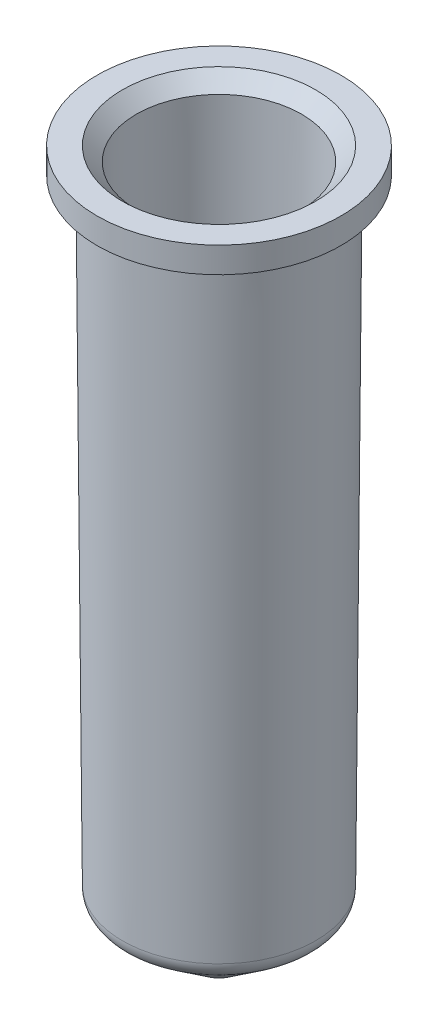
ISO-10303-21;
HEADER;
FILE_DESCRIPTION(('STEP AP214'),'2;1');
FILE_NAME('part.step','',(''),(''),'','','');
FILE_SCHEMA(('AUTOMOTIVE_DESIGN { 1 0 10303 214 1 1 1 1 }'));
ENDSEC;
DATA;
#1=APPLICATION_CONTEXT('core data for automotive mechanical design processes');
#2=APPLICATION_PROTOCOL_DEFINITION('international standard','automotive_design',2000,#1);
#3=PRODUCT_CONTEXT('',#1,'mechanical');
#4=PRODUCT('Part','Part','',(#3));
#5=PRODUCT_RELATED_PRODUCT_CATEGORY('part','',(#4));
#6=PRODUCT_DEFINITION_FORMATION('','',#4);
#7=PRODUCT_DEFINITION_CONTEXT('part definition',#1,'design');
#8=PRODUCT_DEFINITION('design','',#6,#7);
#9=PRODUCT_DEFINITION_SHAPE('','',#8);
#10=(LENGTH_UNIT() NAMED_UNIT(*) SI_UNIT(.MILLI.,.METRE.));
#11=(NAMED_UNIT(*) PLANE_ANGLE_UNIT() SI_UNIT($,.RADIAN.));
#12=(NAMED_UNIT(*) SI_UNIT($,.STERADIAN.) SOLID_ANGLE_UNIT());
#13=UNCERTAINTY_MEASURE_WITH_UNIT(LENGTH_MEASURE(1.E-05),#10,'distance_accuracy_value','');
#14=(GEOMETRIC_REPRESENTATION_CONTEXT(3) GLOBAL_UNCERTAINTY_ASSIGNED_CONTEXT((#13)) GLOBAL_UNIT_ASSIGNED_CONTEXT((#10,
#11,#12)) REPRESENTATION_CONTEXT('',''));
#15=CARTESIAN_POINT('',(0.,0.,0.));
#16=DIRECTION('',(0.,0.,1.));
#17=DIRECTION('',(1.,0.,0.));
#18=AXIS2_PLACEMENT_3D('',#15,#16,#17);
#19=CARTESIAN_POINT('',(0.,-1.85596316128031,0.));
#20=DIRECTION('',(0.,-1.,0.));
#21=DIRECTION('',(1.,0.,0.));
#22=AXIS2_PLACEMENT_3D('',#19,#20,#21);
#23=SPHERICAL_SURFACE('',#22,2.);
#24=CARTESIAN_POINT('',(0.,-3.45798467690111,0.));
#25=DIRECTION('',(0.,-1.,0.));
#26=DIRECTION('',(0.,0.,-1.));
#27=AXIS2_PLACEMENT_3D('',#24,#25,#26);
#28=CIRCLE('',#27,1.19729990540719);
#29=CARTESIAN_POINT('',(0.,-3.4579846769011,1.19729990540719));
#30=VERTEX_POINT('',#29);
#31=EDGE_CURVE('E64',#30,#30,#28,.T.);
#32=ORIENTED_EDGE('',*,*,#31,.T.);
#33=EDGE_LOOP('',(#32));
#34=FACE_BOUND('',#33,.T.);
#35=ADVANCED_FACE('F30',(#34),#23,.T.);
#36=CARTESIAN_POINT('',(0.,-1.85596316128031,0.));
#37=DIRECTION('',(0.,-1.,0.));
#38=DIRECTION('',(1.,0.,0.));
#39=AXIS2_PLACEMENT_3D('',#36,#37,#38);
#40=SPHERICAL_SURFACE('',#39,1.);
#41=CARTESIAN_POINT('',(0.,-2.65697391909071,0.));
#42=DIRECTION('',(0.,-1.,0.));
#43=DIRECTION('',(0.,0.,-1.));
#44=AXIS2_PLACEMENT_3D('',#41,#42,#43);
#45=CIRCLE('',#44,0.598649952703593);
#46=CARTESIAN_POINT('',(0.,-2.65697391909071,0.598649952703593));
#47=VERTEX_POINT('',#46);
#48=EDGE_CURVE('E10',#47,#47,#45,.T.);
#49=ORIENTED_EDGE('',*,*,#48,.F.);
#50=EDGE_LOOP('',(#49));
#51=FACE_BOUND('',#50,.T.);
#52=ADVANCED_FACE('F81',(#51),#40,.F.);
#53=CARTESIAN_POINT('',(0.,0.,0.));
#54=DIRECTION('',(0.,1.,0.));
#55=DIRECTION('',(0.,0.,1.));
#56=AXIS2_PLACEMENT_3D('',#53,#54,#55);
#57=CONICAL_SURFACE('',#56,4.15375704458883,0.928981711324446);
#58=CARTESIAN_POINT('',(0.,0.,0.));
#59=DIRECTION('',(0.,-1.,0.));
#60=DIRECTION('',(0.,0.,-1.));
#61=AXIS2_PLACEMENT_3D('',#58,#59,#60);
#62=CIRCLE('',#61,4.15375704458883);
#63=CARTESIAN_POINT('',(0.,0.,4.15375704458883));
#64=VERTEX_POINT('',#63);
#65=EDGE_CURVE('E36',#64,#64,#62,.T.);
#66=CARTESIAN_POINT('',(0.,-2.65697391909071,0.598649952703593));
#67=CARTESIAN_POINT('',(0.,-2.62929710743351,0.635682318244065));
#68=CARTESIAN_POINT('',(0.,-2.60162029577632,0.672714683784536));
#69=CARTESIAN_POINT('',(0.,-2.54626667246193,0.746779414865478));
#70=CARTESIAN_POINT('',(0.,-2.51858986080473,0.78381178040595));
#71=CARTESIAN_POINT('',(0.,-2.46323623749034,0.857876511486892));
#72=CARTESIAN_POINT('',(0.,-2.43555942583315,0.894908877027363));
#73=CARTESIAN_POINT('',(0.,-2.38020580251876,0.968973608108305));
#74=CARTESIAN_POINT('',(0.,-2.35252899086156,1.00600597364878));
#75=CARTESIAN_POINT('',(0.,-2.29717536754717,1.08007070472972));
#76=CARTESIAN_POINT('',(0.,-2.26949855588998,1.11710307027019));
#77=CARTESIAN_POINT('',(0.,-2.21414493257559,1.19116780135113));
#78=CARTESIAN_POINT('',(0.,-2.18646812091839,1.2282001668916));
#79=CARTESIAN_POINT('',(0.,-2.13111449760401,1.30226489797255));
#80=CARTESIAN_POINT('',(0.,-2.10343768594681,1.33929726351302));
#81=CARTESIAN_POINT('',(0.,-2.04808406263242,1.41336199459396));
#82=CARTESIAN_POINT('',(0.,-2.02040725097523,1.45039436013443));
#83=CARTESIAN_POINT('',(0.,-1.96505362766084,1.52445909121537));
#84=CARTESIAN_POINT('',(0.,-1.93737681600364,1.56149145675585));
#85=CARTESIAN_POINT('',(0.,-1.88202319268925,1.63555618783679));
#86=CARTESIAN_POINT('',(0.,-1.85434638103206,1.67258855337726));
#87=CARTESIAN_POINT('',(0.,-1.79899275771767,1.7466532844582));
#88=CARTESIAN_POINT('',(0.,-1.77131594606047,1.78368564999867));
#89=CARTESIAN_POINT('',(0.,-1.71596232274608,1.85775038107961));
#90=CARTESIAN_POINT('',(0.,-1.68828551108889,1.89478274662009));
#91=CARTESIAN_POINT('',(0.,-1.6329318877745,1.96884747770103));
#92=CARTESIAN_POINT('',(0.,-1.6052550761173,2.0058798432415));
#93=CARTESIAN_POINT('',(0.,-1.54990145280291,2.07994457432244));
#94=CARTESIAN_POINT('',(0.,-1.52222464114572,2.11697693986291));
#95=CARTESIAN_POINT('',(0.,-1.46687101783133,2.19104167094386));
#96=CARTESIAN_POINT('',(0.,-1.43919420617413,2.22807403648433));
#97=CARTESIAN_POINT('',(0.,-1.38384058285974,2.30213876756527));
#98=CARTESIAN_POINT('',(0.,-1.35616377120255,2.33917113310574));
#99=CARTESIAN_POINT('',(0.,-1.30081014788816,2.41323586418668));
#100=CARTESIAN_POINT('',(0.,-1.27313333623096,2.45026822972715));
#101=CARTESIAN_POINT('',(0.,-1.21777971291657,2.5243329608081));
#102=CARTESIAN_POINT('',(0.,-1.19010290125938,2.56136532634857));
#103=CARTESIAN_POINT('',(0.,-1.13474927794499,2.63543005742951));
#104=CARTESIAN_POINT('',(0.,-1.1070724662878,2.67246242296998));
#105=CARTESIAN_POINT('',(0.,-1.05171884297341,2.74652715405092));
#106=CARTESIAN_POINT('',(0.,-1.02404203131621,2.7835595195914));
#107=CARTESIAN_POINT('',(0.,-0.968688408001821,2.85762425067234));
#108=CARTESIAN_POINT('',(0.,-0.941011596344626,2.89465661621281));
#109=CARTESIAN_POINT('',(0.,-0.885657973030236,2.96872134729375));
#110=CARTESIAN_POINT('',(0.,-0.857981161373041,3.00575371283422));
#111=CARTESIAN_POINT('',(0.,-0.802627538058651,3.07981844391517));
#112=CARTESIAN_POINT('',(0.,-0.774950726401456,3.11685080945564));
#113=CARTESIAN_POINT('',(0.,-0.719597103087067,3.19091554053658));
#114=CARTESIAN_POINT('',(0.,-0.691920291429872,3.22794790607705));
#115=CARTESIAN_POINT('',(0.,-0.636566668115482,3.30201263715799));
#116=CARTESIAN_POINT('',(0.,-0.608889856458287,3.33904500269846));
#117=CARTESIAN_POINT('',(0.,-0.553536233143898,3.41310973377941));
#118=CARTESIAN_POINT('',(0.,-0.525859421486703,3.45014209931988));
#119=CARTESIAN_POINT('',(0.,-0.470505798172313,3.52420683040082));
#120=CARTESIAN_POINT('',(0.,-0.442828986515118,3.56123919594129));
#121=CARTESIAN_POINT('',(0.,-0.387475363200728,3.63530392702223));
#122=CARTESIAN_POINT('',(0.,-0.359798551543533,3.6723362925627));
#123=CARTESIAN_POINT('',(0.,-0.304444928229143,3.74640102364365));
#124=CARTESIAN_POINT('',(0.,-0.276768116571949,3.78343338918412));
#125=CARTESIAN_POINT('',(0.,-0.221414493257559,3.85749812026506));
#126=CARTESIAN_POINT('',(0.,-0.193737681600364,3.89453048580553));
#127=CARTESIAN_POINT('',(0.,-0.138384058285974,3.96859521688647));
#128=CARTESIAN_POINT('',(0.,-0.11070724662878,4.00562758242694));
#129=CARTESIAN_POINT('',(0.,-0.0553536233143898,4.07969231350789));
#130=CARTESIAN_POINT('',(0.,-0.0276768116571949,4.11672467904836));
#131=CARTESIAN_POINT('',(0.,0.,4.15375704458883));
#132=B_SPLINE_CURVE_WITH_KNOTS('',3,(#66,#67,#68,#69,#70,#71,#72,#73,#74,#75,#76,#77,#78,#79,
#80,#81,#82,#83,#84,#85,#86,#87,#88,#89,#90,#91,#92,#93,#94,#95,#96,#97,#98,#99,#100,#101,#102,
#103,#104,#105,#106,#107,#108,#109,#110,#111,#112,#113,#114,#115,#116,#117,#118,#119,#120,#121,
#122,#123,#124,#125,#126,#127,#128,#129,#130,#131),.UNSPECIFIED.,.F.,.F.,(4,2,2,2,2,2,2,2,2,2,2,
2,2,2,2,2,2,2,2,2,2,2,2,2,2,2,2,2,2,2,2,2,4),(0.,0.138696135523952,0.277392271047903,
0.416088406571854,0.554784542095805,0.693480677619757,0.832176813143708,0.970872948667659,
1.10956908419161,1.24826521971556,1.38696135523951,1.52565749076346,1.66435362628742,
1.80304976181137,1.94174589733532,2.08044203285927,2.21913816838322,2.35783430390717,
2.49653043943112,2.63522657495507,2.77392271047903,2.91261884600298,3.05131498152693,
3.19001111705088,3.32870725257483,3.46740338809878,3.60609952362273,3.74479565914668,
3.88349179467064,4.02218793019459,4.16088406571854,4.29958020124249,4.43827633676644),.UNSPECIFIED.);
#133=EDGE_CURVE('BSEAM85',#47,#64,#132,.T.);
#134=ORIENTED_EDGE('',*,*,#48,.T.);
#135=ORIENTED_EDGE('',*,*,#65,.F.);
#136=ORIENTED_EDGE('',*,*,#133,.T.);
#137=ORIENTED_EDGE('',*,*,#133,.F.);
#138=EDGE_LOOP('',(#134,#136,#135,#137));
#139=FACE_BOUND('',#138,.T.);
#140=ADVANCED_FACE('F85',(#139),#57,.F.);
#141=CARTESIAN_POINT('',(0.,33.3940368387197,0.));
#142=DIRECTION('',(0.,1.,0.));
#143=DIRECTION('',(0.,0.,1.));
#144=AXIS2_PLACEMENT_3D('',#141,#142,#143);
#145=CONICAL_SURFACE('',#144,4.40462952755728,0.00751235212431576);
#146=ORIENTED_EDGE('',*,*,#65,.T.);
#147=EDGE_LOOP('',(#146));
#148=FACE_BOUND('',#147,.T.);
#149=CARTESIAN_POINT('',(0.,33.3940368387197,0.));
#150=DIRECTION('',(0.,-1.,0.));
#151=DIRECTION('',(0.,0.,-1.));
#152=AXIS2_PLACEMENT_3D('',#149,#150,#151);
#153=CIRCLE('',#152,4.40462952755728);
#154=CARTESIAN_POINT('',(0.,33.3940368387197,-4.40462952755728));
#155=VERTEX_POINT('',#154);
#156=EDGE_CURVE('E40',#155,#155,#153,.T.);
#157=ORIENTED_EDGE('',*,*,#156,.F.);
#158=EDGE_LOOP('',(#157));
#159=FACE_BOUND('',#158,.T.);
#160=ADVANCED_FACE('F90',(#148,#159),#145,.F.);
#161=CARTESIAN_POINT('',(0.,34.1440368387197,0.));
#162=DIRECTION('',(0.,1.,0.));
#163=DIRECTION('',(0.,0.,1.));
#164=AXIS2_PLACEMENT_3D('',#161,#162,#163);
#165=CONICAL_SURFACE('',#164,5.15462952755728,0.785398163397448);
#166=ORIENTED_EDGE('',*,*,#156,.T.);
#167=EDGE_LOOP('',(#166));
#168=FACE_BOUND('',#167,.T.);
#169=CARTESIAN_POINT('',(0.,34.1440368387197,0.));
#170=DIRECTION('',(0.,-1.,0.));
#171=DIRECTION('',(0.,0.,-1.));
#172=AXIS2_PLACEMENT_3D('',#169,#170,#171);
#173=CIRCLE('',#172,5.15462952755728);
#174=CARTESIAN_POINT('',(0.,34.1440368387197,-5.15462952755728));
#175=VERTEX_POINT('',#174);
#176=EDGE_CURVE('E44',#175,#175,#173,.T.);
#177=ORIENTED_EDGE('',*,*,#176,.F.);
#178=EDGE_LOOP('',(#177));
#179=FACE_BOUND('',#178,.T.);
#180=ADVANCED_FACE('F95',(#168,#179),#165,.F.);
#181=CARTESIAN_POINT('',(5.15462952755728,34.1440368387197,0.));
#182=DIRECTION('',(0.,1.,0.));
#183=DIRECTION('',(0.,0.,1.));
#184=AXIS2_PLACEMENT_3D('',#181,#182,#183);
#185=PLANE('',#184);
#186=ORIENTED_EDGE('',*,*,#176,.T.);
#187=EDGE_LOOP('',(#186));
#188=FACE_BOUND('',#187,.T.);
#189=CARTESIAN_POINT('',(0.,34.1440368387197,0.));
#190=DIRECTION('',(0.,-1.,0.));
#191=DIRECTION('',(0.,0.,-1.));
#192=AXIS2_PLACEMENT_3D('',#189,#190,#191);
#193=CIRCLE('',#192,6.50462952755728);
#194=CARTESIAN_POINT('',(0.,34.1440368387197,-6.50462952755728));
#195=VERTEX_POINT('',#194);
#196=EDGE_CURVE('E49',#195,#195,#193,.T.);
#197=ORIENTED_EDGE('',*,*,#196,.F.);
#198=EDGE_LOOP('',(#197));
#199=FACE_BOUND('',#198,.T.);
#200=ADVANCED_FACE('F98',(#188,#199),#185,.T.);
#201=CARTESIAN_POINT('',(0.,0.,0.));
#202=DIRECTION('',(0.,-1.,0.));
#203=DIRECTION('',(0.,0.,-1.));
#204=AXIS2_PLACEMENT_3D('',#201,#202,#203);
#205=CYLINDRICAL_SURFACE('',#204,6.50462952755728);
#206=ORIENTED_EDGE('',*,*,#196,.T.);
#207=EDGE_LOOP('',(#206));
#208=FACE_BOUND('',#207,.T.);
#209=CARTESIAN_POINT('',(0.,32.7740368387197,0.));
#210=DIRECTION('',(0.,-1.,0.));
#211=DIRECTION('',(0.,0.,-1.));
#212=AXIS2_PLACEMENT_3D('',#209,#210,#211);
#213=CIRCLE('',#212,6.50462952755728);
#214=CARTESIAN_POINT('',(0.,32.7740368387197,-6.50462952755728));
#215=VERTEX_POINT('',#214);
#216=EDGE_CURVE('E52',#215,#215,#213,.T.);
#217=ORIENTED_EDGE('',*,*,#216,.F.);
#218=EDGE_LOOP('',(#217));
#219=FACE_BOUND('',#218,.T.);
#220=ADVANCED_FACE('F102',(#208,#219),#205,.T.);
#221=CARTESIAN_POINT('',(6.50462952755728,32.7740368387197,0.));
#222=DIRECTION('',(0.,-1.,0.));
#223=DIRECTION('',(0.,0.,-1.));
#224=AXIS2_PLACEMENT_3D('',#221,#222,#223);
#225=PLANE('',#224);
#226=ORIENTED_EDGE('',*,*,#216,.T.);
#227=EDGE_LOOP('',(#226));
#228=FACE_BOUND('',#227,.T.);
#229=CARTESIAN_POINT('',(0.,32.7740368387197,0.));
#230=DIRECTION('',(0.,-1.,0.));
#231=DIRECTION('',(0.,0.,-1.));
#232=AXIS2_PLACEMENT_3D('',#229,#230,#231);
#233=CIRCLE('',#232,5.4);
#234=CARTESIAN_POINT('',(0.,32.7740368387197,-5.4));
#235=VERTEX_POINT('',#234);
#236=EDGE_CURVE('E55',#235,#235,#233,.T.);
#237=ORIENTED_EDGE('',*,*,#236,.F.);
#238=EDGE_LOOP('',(#237));
#239=FACE_BOUND('',#238,.T.);
#240=ADVANCED_FACE('F106',(#228,#239),#225,.T.);
#241=CARTESIAN_POINT('',(0.,-0.00751228146403934,0.));
#242=DIRECTION('',(0.,1.,0.));
#243=DIRECTION('',(0.,0.,1.));
#244=AXIS2_PLACEMENT_3D('',#241,#242,#243);
#245=CONICAL_SURFACE('',#244,5.15372882700432,0.00751235212431575);
#246=ORIENTED_EDGE('',*,*,#236,.T.);
#247=EDGE_LOOP('',(#246));
#248=FACE_BOUND('',#247,.T.);
#249=CARTESIAN_POINT('',(0.,-0.00751228146403934,0.));
#250=DIRECTION('',(0.,-1.,0.));
#251=DIRECTION('',(0.,0.,-1.));
#252=AXIS2_PLACEMENT_3D('',#249,#250,#251);
#253=CIRCLE('',#252,5.15372882700432);
#254=CARTESIAN_POINT('',(0.,-0.00751228146403934,-5.15372882700432));
#255=VERTEX_POINT('',#254);
#256=EDGE_CURVE('E58',#255,#255,#253,.T.);
#257=ORIENTED_EDGE('',*,*,#256,.F.);
#258=EDGE_LOOP('',(#257));
#259=FACE_BOUND('',#258,.T.);
#260=ADVANCED_FACE('F77',(#248,#259),#245,.T.);
#261=CARTESIAN_POINT('',(0.,0.,0.));
#262=DIRECTION('',(0.,-1.,0.));
#263=DIRECTION('',(0.,0.,-1.));
#264=AXIS2_PLACEMENT_3D('',#261,#262,#263);
#265=TOROIDAL_SURFACE('',#264,4.15375704458883,1.);
#266=ORIENTED_EDGE('',*,*,#256,.T.);
#267=EDGE_LOOP('',(#266));
#268=FACE_BOUND('',#267,.T.);
#269=CARTESIAN_POINT('',(0.,-0.801010757810397,0.));
#270=DIRECTION('',(0.,-1.,0.));
#271=DIRECTION('',(0.,0.,-1.));
#272=AXIS2_PLACEMENT_3D('',#269,#270,#271);
#273=CIRCLE('',#272,4.75240699729242);
#274=CARTESIAN_POINT('',(0.,-0.801010757810397,4.75240699729242));
#275=VERTEX_POINT('',#274);
#276=EDGE_CURVE('E61',#275,#275,#273,.T.);
#277=ORIENTED_EDGE('',*,*,#276,.F.);
#278=EDGE_LOOP('',(#277));
#279=FACE_BOUND('',#278,.T.);
#280=ADVANCED_FACE('F71',(#268,#279),#265,.T.);
#281=CARTESIAN_POINT('',(0.,-3.45798467690111,0.));
#282=DIRECTION('',(0.,1.,0.));
#283=DIRECTION('',(0.,0.,1.));
#284=AXIS2_PLACEMENT_3D('',#281,#282,#283);
#285=CONICAL_SURFACE('',#284,1.19729990540719,0.928981711324446);
#286=CARTESIAN_POINT('',(0.,-0.801010757810397,4.75240699729242));
#287=CARTESIAN_POINT('',(0.,-0.828687569467592,4.71537463175195));
#288=CARTESIAN_POINT('',(0.,-0.856364381124787,4.67834226621148));
#289=CARTESIAN_POINT('',(0.,-0.911718004439176,4.60427753513054));
#290=CARTESIAN_POINT('',(0.,-0.939394816096371,4.56724516959007));
#291=CARTESIAN_POINT('',(0.,-0.994748439410761,4.49318043850912));
#292=CARTESIAN_POINT('',(0.,-1.02242525106796,4.45614807296865));
#293=CARTESIAN_POINT('',(0.,-1.07777887438235,4.38208334188771));
#294=CARTESIAN_POINT('',(0.,-1.10545568603954,4.34505097634724));
#295=CARTESIAN_POINT('',(0.,-1.16080930935393,4.2709862452663));
#296=CARTESIAN_POINT('',(0.,-1.18848612101112,4.23395387972583));
#297=CARTESIAN_POINT('',(0.,-1.24383974432551,4.15988914864488));
#298=CARTESIAN_POINT('',(0.,-1.27151655598271,4.12285678310441));
#299=CARTESIAN_POINT('',(0.,-1.3268701792971,4.04879205202347));
#300=CARTESIAN_POINT('',(0.,-1.35454699095429,4.011759686483));
#301=CARTESIAN_POINT('',(0.,-1.40990061426868,3.93769495540206));
#302=CARTESIAN_POINT('',(0.,-1.43757742592588,3.90066258986159));
#303=CARTESIAN_POINT('',(0.,-1.49293104924027,3.82659785878064));
#304=CARTESIAN_POINT('',(0.,-1.52060786089746,3.78956549324017));
#305=CARTESIAN_POINT('',(0.,-1.57596148421185,3.71550076215923));
#306=CARTESIAN_POINT('',(0.,-1.60363829586905,3.67846839661876));
#307=CARTESIAN_POINT('',(0.,-1.65899191918344,3.60440366553782));
#308=CARTESIAN_POINT('',(0.,-1.68666873084063,3.56737129999734));
#309=CARTESIAN_POINT('',(0.,-1.74202235415502,3.4933065689164));
#310=CARTESIAN_POINT('',(0.,-1.76969916581222,3.45627420337593));
#311=CARTESIAN_POINT('',(0.,-1.82505278912661,3.38220947229499));
#312=CARTESIAN_POINT('',(0.,-1.8527296007838,3.34517710675452));
#313=CARTESIAN_POINT('',(0.,-1.90808322409819,3.27111237567358));
#314=CARTESIAN_POINT('',(0.,-1.93576003575539,3.2340800101331));
#315=CARTESIAN_POINT('',(0.,-1.99111365906978,3.16001527905216));
#316=CARTESIAN_POINT('',(0.,-2.01879047072697,3.12298291351169));
#317=CARTESIAN_POINT('',(0.,-2.07414409404136,3.04891818243075));
#318=CARTESIAN_POINT('',(0.,-2.10182090569856,3.01188581689028));
#319=CARTESIAN_POINT('',(0.,-2.15717452901295,2.93782108580933));
#320=CARTESIAN_POINT('',(0.,-2.18485134067014,2.90078872026886));
#321=CARTESIAN_POINT('',(0.,-2.24020496398453,2.82672398918792));
#322=CARTESIAN_POINT('',(0.,-2.26788177564173,2.78969162364745));
#323=CARTESIAN_POINT('',(0.,-2.32323539895612,2.71562689256651));
#324=CARTESIAN_POINT('',(0.,-2.35091221061331,2.67859452702604));
#325=CARTESIAN_POINT('',(0.,-2.4062658339277,2.60452979594509));
#326=CARTESIAN_POINT('',(0.,-2.43394264558489,2.56749743040462));
#327=CARTESIAN_POINT('',(0.,-2.48929626889928,2.49343269932368));
#328=CARTESIAN_POINT('',(0.,-2.51697308055648,2.45640033378321));
#329=CARTESIAN_POINT('',(0.,-2.57232670387087,2.38233560270227));
#330=CARTESIAN_POINT('',(0.,-2.60000351552806,2.3453032371618));
#331=CARTESIAN_POINT('',(0.,-2.65535713884245,2.27123850608085));
#332=CARTESIAN_POINT('',(0.,-2.68303395049965,2.23420614054038));
#333=CARTESIAN_POINT('',(0.,-2.73838757381404,2.16014140945944));
#334=CARTESIAN_POINT('',(0.,-2.76606438547123,2.12310904391897));
#335=CARTESIAN_POINT('',(0.,-2.82141800878562,2.04904431283802));
#336=CARTESIAN_POINT('',(0.,-2.84909482044282,2.01201194729755));
#337=CARTESIAN_POINT('',(0.,-2.90444844375721,1.93794721621661));
#338=CARTESIAN_POINT('',(0.,-2.9321252554144,1.90091485067614));
#339=CARTESIAN_POINT('',(0.,-2.98747887872879,1.8268501195952));
#340=CARTESIAN_POINT('',(0.,-3.01515569038599,1.78981775405473));
#341=CARTESIAN_POINT('',(0.,-3.07050931370038,1.71575302297378));
#342=CARTESIAN_POINT('',(0.,-3.09818612535757,1.67872065743331));
#343=CARTESIAN_POINT('',(0.,-3.15353974867196,1.60465592635237));
#344=CARTESIAN_POINT('',(0.,-3.18121656032916,1.5676235608119));
#345=CARTESIAN_POINT('',(0.,-3.23657018364355,1.49355882973096));
#346=CARTESIAN_POINT('',(0.,-3.26424699530074,1.45652646419049));
#347=CARTESIAN_POINT('',(0.,-3.31960061861513,1.38246173310954));
#348=CARTESIAN_POINT('',(0.,-3.34727743027232,1.34542936756907));
#349=CARTESIAN_POINT('',(0.,-3.40263105358671,1.27136463648813));
#350=CARTESIAN_POINT('',(0.,-3.43030786524391,1.23433227094766));
#351=CARTESIAN_POINT('',(0.,-3.4579846769011,1.19729990540719));
#352=B_SPLINE_CURVE_WITH_KNOTS('',3,(#286,#287,#288,#289,#290,#291,#292,#293,#294,#295,#296,
#297,#298,#299,#300,#301,#302,#303,#304,#305,#306,#307,#308,#309,#310,#311,#312,#313,#314,#315,
#316,#317,#318,#319,#320,#321,#322,#323,#324,#325,#326,#327,#328,#329,#330,#331,#332,#333,#334,
#335,#336,#337,#338,#339,#340,#341,#342,#343,#344,#345,#346,#347,#348,#349,#350,#351),
.UNSPECIFIED.,.F.,.F.,(4,2,2,2,2,2,2,2,2,2,2,2,2,2,2,2,2,2,2,2,2,2,2,2,2,2,2,2,2,2,2,2,4),(0.,
0.138696135523952,0.277392271047903,0.416088406571854,0.554784542095804,0.693480677619757,
0.832176813143708,0.970872948667659,1.10956908419161,1.24826521971556,1.38696135523951,
1.52565749076346,1.66435362628742,1.80304976181137,1.94174589733532,2.08044203285927,
2.21913816838322,2.35783430390717,2.49653043943112,2.63522657495507,2.77392271047903,
2.91261884600298,3.05131498152693,3.19001111705088,3.32870725257483,3.46740338809878,
3.60609952362273,3.74479565914668,3.88349179467064,4.02218793019459,4.16088406571854,
4.29958020124249,4.43827633676644),.UNSPECIFIED.);
#353=EDGE_CURVE('BSEAM69',#275,#30,#352,.T.);
#354=ORIENTED_EDGE('',*,*,#276,.T.);
#355=ORIENTED_EDGE('',*,*,#31,.F.);
#356=ORIENTED_EDGE('',*,*,#353,.T.);
#357=ORIENTED_EDGE('',*,*,#353,.F.);
#358=EDGE_LOOP('',(#354,#356,#355,#357));
#359=FACE_BOUND('',#358,.T.);
#360=ADVANCED_FACE('F69',(#359),#285,.T.);
#361=CLOSED_SHELL('',(#35,#52,#140,#160,#180,#200,#220,#240,#260,#280,#360));
#362=MANIFOLD_SOLID_BREP('B2',#361);
#363=ADVANCED_BREP_SHAPE_REPRESENTATION('',(#18,#362),#14);
#364=SHAPE_DEFINITION_REPRESENTATION(#9,#363);
ENDSEC;
END-ISO-10303-21;
